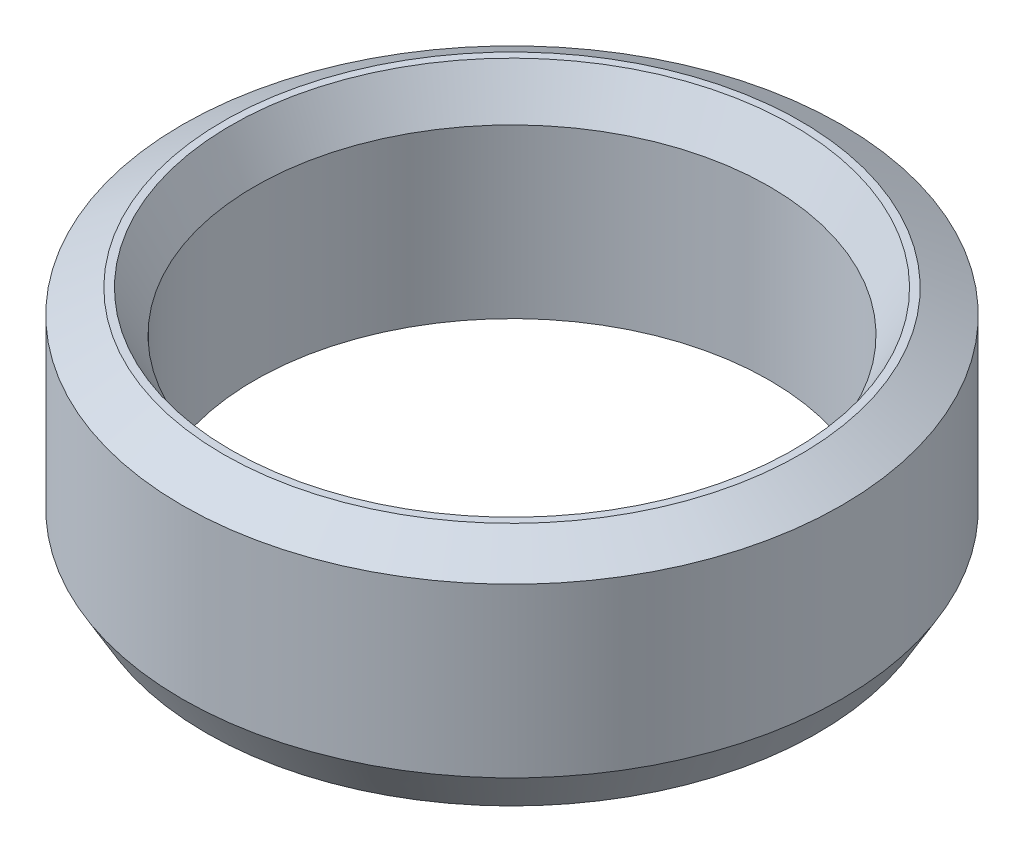
ISO-10303-21;
HEADER;
FILE_DESCRIPTION(('STEP AP214'),'2;1');
FILE_NAME('part.step','',(''),(''),'','','');
FILE_SCHEMA(('AUTOMOTIVE_DESIGN { 1 0 10303 214 1 1 1 1 }'));
ENDSEC;
DATA;
#1=APPLICATION_CONTEXT('core data for automotive mechanical design processes');
#2=APPLICATION_PROTOCOL_DEFINITION('international standard','automotive_design',2000,#1);
#3=PRODUCT_CONTEXT('',#1,'mechanical');
#4=PRODUCT('Part','Part','',(#3));
#5=PRODUCT_RELATED_PRODUCT_CATEGORY('part','',(#4));
#6=PRODUCT_DEFINITION_FORMATION('','',#4);
#7=PRODUCT_DEFINITION_CONTEXT('part definition',#1,'design');
#8=PRODUCT_DEFINITION('design','',#6,#7);
#9=PRODUCT_DEFINITION_SHAPE('','',#8);
#10=(LENGTH_UNIT() NAMED_UNIT(*) SI_UNIT(.MILLI.,.METRE.));
#11=(NAMED_UNIT(*) PLANE_ANGLE_UNIT() SI_UNIT($,.RADIAN.));
#12=(NAMED_UNIT(*) SI_UNIT($,.STERADIAN.) SOLID_ANGLE_UNIT());
#13=UNCERTAINTY_MEASURE_WITH_UNIT(LENGTH_MEASURE(1.E-05),#10,'distance_accuracy_value','');
#14=(GEOMETRIC_REPRESENTATION_CONTEXT(3) GLOBAL_UNCERTAINTY_ASSIGNED_CONTEXT((#13)) GLOBAL_UNIT_ASSIGNED_CONTEXT((#10,
#11,#12)) REPRESENTATION_CONTEXT('',''));
#15=CARTESIAN_POINT('',(0.,0.,0.));
#16=DIRECTION('',(0.,0.,1.));
#17=DIRECTION('',(1.,0.,0.));
#18=AXIS2_PLACEMENT_3D('',#15,#16,#17);
#19=CARTESIAN_POINT('',(0.,28.2075986922021,0.));
#20=DIRECTION('',(0.,-1.,0.));
#21=DIRECTION('',(0.,0.,-1.));
#22=AXIS2_PLACEMENT_3D('',#19,#20,#21);
#23=CYLINDRICAL_SURFACE('',#22,40.);
#24=CARTESIAN_POINT('',(0.,4.98222311545024,0.));
#25=DIRECTION('',(0.,1.,0.));
#26=DIRECTION('',(0.,0.,1.));
#27=AXIS2_PLACEMENT_3D('',#24,#25,#26);
#28=CIRCLE('',#27,40.);
#29=CARTESIAN_POINT('',(0.,4.98222311545024,40.));
#30=VERTEX_POINT('',#29);
#31=EDGE_CURVE('E10',#30,#30,#28,.T.);
#32=ORIENTED_EDGE('',*,*,#31,.T.);
#33=EDGE_LOOP('',(#32));
#34=FACE_BOUND('',#33,.T.);
#35=CARTESIAN_POINT('',(0.,25.3311108353341,0.));
#36=DIRECTION('',(0.,1.,0.));
#37=DIRECTION('',(0.,0.,1.));
#38=AXIS2_PLACEMENT_3D('',#35,#36,#37);
#39=CIRCLE('',#38,40.);
#40=CARTESIAN_POINT('',(0.,25.3311108353341,40.));
#41=VERTEX_POINT('',#40);
#42=EDGE_CURVE('E50',#41,#41,#39,.F.);
#43=ORIENTED_EDGE('',*,*,#42,.T.);
#44=EDGE_LOOP('',(#43));
#45=FACE_BOUND('',#44,.T.);
#46=ADVANCED_FACE('F39',(#34,#45),#23,.T.);
#47=CARTESIAN_POINT('',(0.,28.2075986922021,0.));
#48=DIRECTION('',(0.,1.,0.));
#49=DIRECTION('',(0.,0.,1.));
#50=AXIS2_PLACEMENT_3D('',#47,#48,#49);
#51=PLANE('',#50);
#52=CARTESIAN_POINT('',(0.,28.2075986922021,0.));
#53=DIRECTION('',(0.,1.,0.));
#54=DIRECTION('',(0.,0.,1.));
#55=AXIS2_PLACEMENT_3D('',#52,#53,#54);
#56=CIRCLE('',#55,34.1078035838853);
#57=CARTESIAN_POINT('',(0.,28.2075986922021,34.1078035838853));
#58=VERTEX_POINT('',#57);
#59=EDGE_CURVE('E58',#58,#58,#56,.F.);
#60=ORIENTED_EDGE('',*,*,#59,.T.);
#61=EDGE_LOOP('',(#60));
#62=FACE_BOUND('',#61,.T.);
#63=CARTESIAN_POINT('',(0.,28.2075986922021,0.));
#64=DIRECTION('',(0.,1.,0.));
#65=DIRECTION('',(0.,0.,1.));
#66=AXIS2_PLACEMENT_3D('',#63,#64,#65);
#67=CIRCLE('',#66,35.0177768845498);
#68=CARTESIAN_POINT('',(0.,28.2075986922021,35.0177768845498));
#69=VERTEX_POINT('',#68);
#70=EDGE_CURVE('E61',#69,#69,#67,.T.);
#71=ORIENTED_EDGE('',*,*,#70,.T.);
#72=EDGE_LOOP('',(#71));
#73=FACE_BOUND('',#72,.T.);
#74=ADVANCED_FACE('F88',(#62,#73),#51,.T.);
#75=CARTESIAN_POINT('',(0.,0.,0.));
#76=DIRECTION('',(0.,1.,0.));
#77=DIRECTION('',(0.,0.,1.));
#78=AXIS2_PLACEMENT_3D('',#75,#76,#77);
#79=PLANE('',#78);
#80=CARTESIAN_POINT('',(0.,0.,0.));
#81=DIRECTION('',(0.,1.,0.));
#82=DIRECTION('',(0.,0.,1.));
#83=AXIS2_PLACEMENT_3D('',#80,#81,#82);
#84=CIRCLE('',#83,36.2135388424676);
#85=CARTESIAN_POINT('',(0.,0.,36.2135388424676));
#86=VERTEX_POINT('',#85);
#87=EDGE_CURVE('E51',#86,#86,#84,.T.);
#88=ORIENTED_EDGE('',*,*,#87,.T.);
#89=EDGE_LOOP('',(#88));
#90=FACE_BOUND('',#89,.T.);
#91=CARTESIAN_POINT('',(0.,0.,0.));
#92=DIRECTION('',(0.,1.,0.));
#93=DIRECTION('',(0.,0.,1.));
#94=AXIS2_PLACEMENT_3D('',#91,#92,#93);
#95=CIRCLE('',#94,37.123512143132);
#96=CARTESIAN_POINT('',(0.,0.,37.123512143132));
#97=VERTEX_POINT('',#96);
#98=EDGE_CURVE('E54',#97,#97,#95,.F.);
#99=ORIENTED_EDGE('',*,*,#98,.T.);
#100=EDGE_LOOP('',(#99));
#101=FACE_BOUND('',#100,.T.);
#102=ADVANCED_FACE('F83',(#90,#101),#79,.F.);
#103=CARTESIAN_POINT('',(0.,28.2075986922021,0.));
#104=DIRECTION('',(0.,-1.,0.));
#105=DIRECTION('',(0.,0.,-1.));
#106=AXIS2_PLACEMENT_3D('',#103,#104,#105);
#107=CYLINDRICAL_SURFACE('',#106,31.2313157270173);
#108=CARTESIAN_POINT('',(0.,23.2253755767519,0.));
#109=DIRECTION('',(0.,1.,0.));
#110=DIRECTION('',(0.,0.,1.));
#111=AXIS2_PLACEMENT_3D('',#108,#109,#110);
#112=CIRCLE('',#111,31.2313157270173);
#113=CARTESIAN_POINT('',(0.,23.2253755767519,31.2313157270173));
#114=VERTEX_POINT('',#113);
#115=EDGE_CURVE('E67',#114,#114,#112,.T.);
#116=ORIENTED_EDGE('',*,*,#115,.T.);
#117=EDGE_LOOP('',(#116));
#118=FACE_BOUND('',#117,.T.);
#119=CARTESIAN_POINT('',(0.,2.87648785686801,0.));
#120=DIRECTION('',(0.,1.,0.));
#121=DIRECTION('',(0.,0.,1.));
#122=AXIS2_PLACEMENT_3D('',#119,#120,#121);
#123=CIRCLE('',#122,31.2313157270173);
#124=CARTESIAN_POINT('',(0.,2.87648785686801,31.2313157270173));
#125=VERTEX_POINT('',#124);
#126=EDGE_CURVE('E69',#125,#125,#123,.F.);
#127=ORIENTED_EDGE('',*,*,#126,.T.);
#128=EDGE_LOOP('',(#127));
#129=FACE_BOUND('',#128,.T.);
#130=ADVANCED_FACE('F71',(#118,#129),#107,.F.);
#131=CARTESIAN_POINT('',(0.,23.2253755767519,0.));
#132=DIRECTION('',(0.,1.,0.));
#133=DIRECTION('',(0.,0.,1.));
#134=AXIS2_PLACEMENT_3D('',#131,#132,#133);
#135=CONICAL_SURFACE('',#134,31.2313157270173,0.523598775598304);
#136=ORIENTED_EDGE('',*,*,#59,.F.);
#137=EDGE_LOOP('',(#136));
#138=FACE_BOUND('',#137,.T.);
#139=ORIENTED_EDGE('',*,*,#115,.F.);
#140=EDGE_LOOP('',(#139));
#141=FACE_BOUND('',#140,.T.);
#142=ADVANCED_FACE('F77',(#138,#141),#135,.F.);
#143=CARTESIAN_POINT('',(0.,0.,0.));
#144=DIRECTION('',(0.,-1.,0.));
#145=DIRECTION('',(0.,0.,-1.));
#146=AXIS2_PLACEMENT_3D('',#143,#144,#145);
#147=CONICAL_SURFACE('',#146,36.2135388424676,1.04719755119659);
#148=ORIENTED_EDGE('',*,*,#126,.F.);
#149=EDGE_LOOP('',(#148));
#150=FACE_BOUND('',#149,.T.);
#151=ORIENTED_EDGE('',*,*,#87,.F.);
#152=EDGE_LOOP('',(#151));
#153=FACE_BOUND('',#152,.T.);
#154=ADVANCED_FACE('F73',(#150,#153),#147,.F.);
#155=CARTESIAN_POINT('',(0.,4.98222311545024,0.));
#156=DIRECTION('',(0.,1.,0.));
#157=DIRECTION('',(0.,0.,1.));
#158=AXIS2_PLACEMENT_3D('',#155,#156,#157);
#159=CONICAL_SURFACE('',#158,40.,0.523598775598304);
#160=ORIENTED_EDGE('',*,*,#98,.F.);
#161=EDGE_LOOP('',(#160));
#162=FACE_BOUND('',#161,.T.);
#163=ORIENTED_EDGE('',*,*,#31,.F.);
#164=EDGE_LOOP('',(#163));
#165=FACE_BOUND('',#164,.T.);
#166=ADVANCED_FACE('F76',(#162,#165),#159,.T.);
#167=CARTESIAN_POINT('',(0.,28.2075986922021,0.));
#168=DIRECTION('',(0.,-1.,0.));
#169=DIRECTION('',(0.,0.,-1.));
#170=AXIS2_PLACEMENT_3D('',#167,#168,#169);
#171=CONICAL_SURFACE('',#170,35.0177768845498,1.04719755119659);
#172=ORIENTED_EDGE('',*,*,#42,.F.);
#173=EDGE_LOOP('',(#172));
#174=FACE_BOUND('',#173,.T.);
#175=ORIENTED_EDGE('',*,*,#70,.F.);
#176=EDGE_LOOP('',(#175));
#177=FACE_BOUND('',#176,.T.);
#178=ADVANCED_FACE('F45',(#174,#177),#171,.T.);
#179=CLOSED_SHELL('',(#46,#74,#102,#130,#142,#154,#166,#178));
#180=MANIFOLD_SOLID_BREP('B2',#179);
#181=ADVANCED_BREP_SHAPE_REPRESENTATION('',(#18,#180),#14);
#182=SHAPE_DEFINITION_REPRESENTATION(#9,#181);
ENDSEC;
END-ISO-10303-21;
